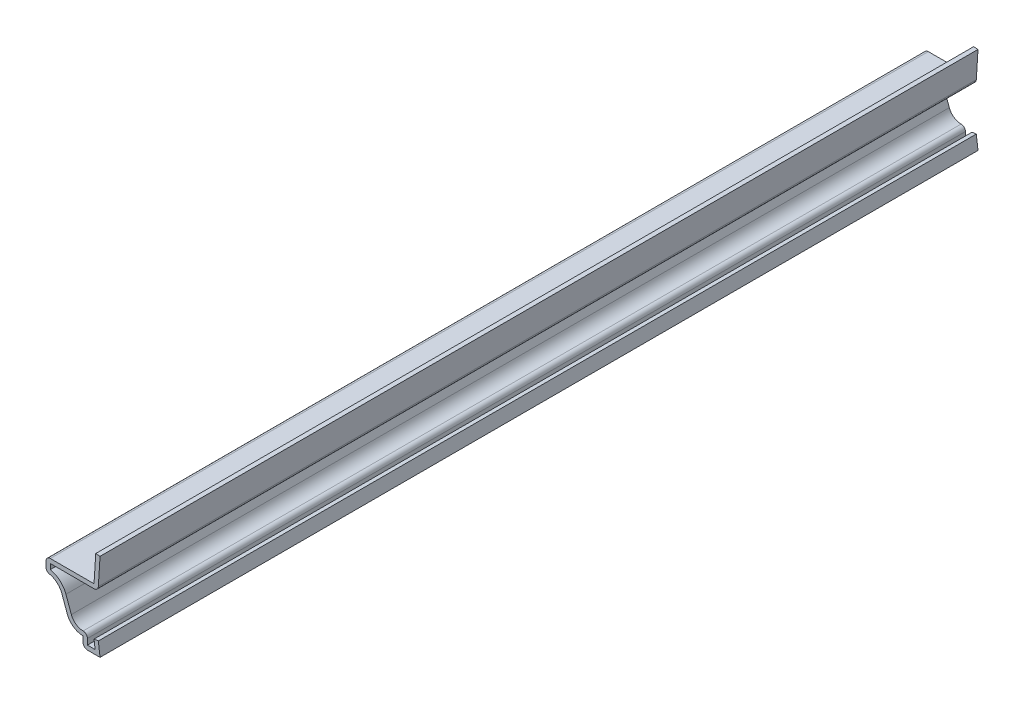
ISO-10303-21;
HEADER;
FILE_DESCRIPTION(('STEP AP214'),'2;1');
FILE_NAME('part.step','',(''),(''),'','','');
FILE_SCHEMA(('AUTOMOTIVE_DESIGN { 1 0 10303 214 1 1 1 1 }'));
ENDSEC;
DATA;
#1=APPLICATION_CONTEXT('core data for automotive mechanical design processes');
#2=APPLICATION_PROTOCOL_DEFINITION('international standard','automotive_design',2000,#1);
#3=PRODUCT_CONTEXT('',#1,'mechanical');
#4=PRODUCT('Part','Part','',(#3));
#5=PRODUCT_RELATED_PRODUCT_CATEGORY('part','',(#4));
#6=PRODUCT_DEFINITION_FORMATION('','',#4);
#7=PRODUCT_DEFINITION_CONTEXT('part definition',#1,'design');
#8=PRODUCT_DEFINITION('design','',#6,#7);
#9=PRODUCT_DEFINITION_SHAPE('','',#8);
#10=(LENGTH_UNIT() NAMED_UNIT(*) SI_UNIT(.MILLI.,.METRE.));
#11=(NAMED_UNIT(*) PLANE_ANGLE_UNIT() SI_UNIT($,.RADIAN.));
#12=(NAMED_UNIT(*) SI_UNIT($,.STERADIAN.) SOLID_ANGLE_UNIT());
#13=UNCERTAINTY_MEASURE_WITH_UNIT(LENGTH_MEASURE(1.E-05),#10,'distance_accuracy_value','');
#14=(GEOMETRIC_REPRESENTATION_CONTEXT(3) GLOBAL_UNCERTAINTY_ASSIGNED_CONTEXT((#13)) GLOBAL_UNIT_ASSIGNED_CONTEXT((#10,
#11,#12)) REPRESENTATION_CONTEXT('',''));
#15=CARTESIAN_POINT('',(0.,0.,0.));
#16=DIRECTION('',(0.,0.,1.));
#17=DIRECTION('',(1.,0.,0.));
#18=AXIS2_PLACEMENT_3D('',#15,#16,#17);
#19=CARTESIAN_POINT('',(0.,0.,-206.375));
#20=DIRECTION('',(0.992156741649221,0.125,0.));
#21=DIRECTION('',(-0.125,0.992156741649222,0.));
#22=AXIS2_PLACEMENT_3D('',#19,#20,#21);
#23=PLANE('',#22);
#24=DIRECTION('',(-0.125,0.992156741649221,0.));
#25=VECTOR('',#24,1.);
#26=CARTESIAN_POINT('',(0.,0.,0.));
#27=LINE('',#26,#25);
#28=CARTESIAN_POINT('',(0.,0.,0.));
#29=VERTEX_POINT('',#28);
#30=CARTESIAN_POINT('',(-0.396875,3.15009765473628,0.));
#31=VERTEX_POINT('',#30);
#32=EDGE_CURVE('E274',#29,#31,#27,.T.);
#33=ORIENTED_EDGE('',*,*,#32,.F.);
#34=DIRECTION('',(0.,0.,1.));
#35=VECTOR('',#34,1.);
#36=CARTESIAN_POINT('',(0.,0.,-206.375));
#37=LINE('',#36,#35);
#38=CARTESIAN_POINT('',(0.,0.,-206.375));
#39=VERTEX_POINT('',#38);
#40=EDGE_CURVE('E227',#39,#29,#37,.T.);
#41=ORIENTED_EDGE('',*,*,#40,.F.);
#42=DIRECTION('',(-0.125,0.992156741649221,0.));
#43=VECTOR('',#42,1.);
#44=CARTESIAN_POINT('',(0.,0.,-206.375));
#45=LINE('',#44,#43);
#46=CARTESIAN_POINT('',(-0.396875,3.15009765473628,-206.375));
#47=VERTEX_POINT('',#46);
#48=EDGE_CURVE('E207',#39,#47,#45,.T.);
#49=ORIENTED_EDGE('',*,*,#48,.T.);
#50=DIRECTION('',(0.,0.,1.));
#51=VECTOR('',#50,1.);
#52=CARTESIAN_POINT('',(-0.396875,3.15009765473628,-206.375));
#53=LINE('',#52,#51);
#54=EDGE_CURVE('E215',#47,#31,#53,.T.);
#55=ORIENTED_EDGE('',*,*,#54,.T.);
#56=EDGE_LOOP('',(#33,#41,#49,#55));
#57=FACE_BOUND('',#56,.T.);
#58=ADVANCED_FACE('F35',(#57),#23,.T.);
#59=CARTESIAN_POINT('',(-3.96875,0.,-206.375));
#60=DIRECTION('',(0.,-1.,0.));
#61=DIRECTION('',(0.,0.,-1.));
#62=AXIS2_PLACEMENT_3D('',#59,#60,#61);
#63=PLANE('',#62);
#64=DIRECTION('',(1.,0.,0.));
#65=VECTOR('',#64,1.);
#66=CARTESIAN_POINT('',(-3.96875,0.,0.));
#67=LINE('',#66,#65);
#68=CARTESIAN_POINT('',(-2.95275,0.,0.));
#69=VERTEX_POINT('',#68);
#70=EDGE_CURVE('E228',#69,#29,#67,.T.);
#71=ORIENTED_EDGE('',*,*,#70,.F.);
#72=DIRECTION('',(0.,0.,1.));
#73=VECTOR('',#72,1.);
#74=CARTESIAN_POINT('',(-2.95275,0.,-206.375));
#75=LINE('',#74,#73);
#76=CARTESIAN_POINT('',(-2.95275,0.,-206.375));
#77=VERTEX_POINT('',#76);
#78=EDGE_CURVE('E364',#69,#77,#75,.F.);
#79=ORIENTED_EDGE('',*,*,#78,.T.);
#80=DIRECTION('',(1.,0.,0.));
#81=VECTOR('',#80,1.);
#82=CARTESIAN_POINT('',(-3.96875,0.,-206.375));
#83=LINE('',#82,#81);
#84=EDGE_CURVE('E223',#77,#39,#83,.T.);
#85=ORIENTED_EDGE('',*,*,#84,.T.);
#86=ORIENTED_EDGE('',*,*,#40,.T.);
#87=EDGE_LOOP('',(#71,#79,#85,#86));
#88=FACE_BOUND('',#87,.T.);
#89=ADVANCED_FACE('F467',(#88),#63,.T.);
#90=CARTESIAN_POINT('',(-3.96875,2.38125,-206.375));
#91=DIRECTION('',(-1.,0.,0.));
#92=DIRECTION('',(0.,0.,1.));
#93=AXIS2_PLACEMENT_3D('',#90,#91,#92);
#94=PLANE('',#93);
#95=DIRECTION('',(0.,-1.,0.));
#96=VECTOR('',#95,1.);
#97=CARTESIAN_POINT('',(-3.96875,2.38125,-206.375));
#98=LINE('',#97,#96);
#99=CARTESIAN_POINT('',(-3.96875,2.38125,-206.375));
#100=VERTEX_POINT('',#99);
#101=CARTESIAN_POINT('',(-3.96875,1.016,-206.375));
#102=VERTEX_POINT('',#101);
#103=EDGE_CURVE('E270',#100,#102,#98,.T.);
#104=ORIENTED_EDGE('',*,*,#103,.T.);
#105=DIRECTION('',(0.,0.,1.));
#106=VECTOR('',#105,1.);
#107=CARTESIAN_POINT('',(-3.96875,1.016,-206.375));
#108=LINE('',#107,#106);
#109=CARTESIAN_POINT('',(-3.96875,1.016,0.));
#110=VERTEX_POINT('',#109);
#111=EDGE_CURVE('E318',#102,#110,#108,.T.);
#112=ORIENTED_EDGE('',*,*,#111,.T.);
#113=DIRECTION('',(0.,-1.,0.));
#114=VECTOR('',#113,1.);
#115=CARTESIAN_POINT('',(-3.96875,2.38125,0.));
#116=LINE('',#115,#114);
#117=CARTESIAN_POINT('',(-3.96875,2.38125,0.));
#118=VERTEX_POINT('',#117);
#119=EDGE_CURVE('E230',#118,#110,#116,.T.);
#120=ORIENTED_EDGE('',*,*,#119,.F.);
#121=DIRECTION('',(0.,0.,1.));
#122=VECTOR('',#121,1.);
#123=CARTESIAN_POINT('',(-3.96875,2.38125,-206.375));
#124=LINE('',#123,#122);
#125=EDGE_CURVE('E319',#100,#118,#124,.T.);
#126=ORIENTED_EDGE('',*,*,#125,.F.);
#127=EDGE_LOOP('',(#104,#112,#120,#126));
#128=FACE_BOUND('',#127,.T.);
#129=ADVANCED_FACE('F459',(#128),#94,.T.);
#130=CARTESIAN_POINT('',(-3.96875,6.35,-206.375));
#131=DIRECTION('',(0.,0.,1.));
#132=DIRECTION('',(1.,0.,0.));
#133=AXIS2_PLACEMENT_3D('',#130,#131,#132);
#134=CYLINDRICAL_SURFACE('',#133,3.96875);
#135=CARTESIAN_POINT('',(-3.96875,6.35,0.));
#136=DIRECTION('',(0.,0.,1.));
#137=DIRECTION('',(1.,0.,0.));
#138=AXIS2_PLACEMENT_3D('',#135,#136,#137);
#139=CIRCLE('',#138,3.96875);
#140=CARTESIAN_POINT('',(-7.69971383235081,4.99689784414105,0.));
#141=VERTEX_POINT('',#140);
#142=EDGE_CURVE('E312',#141,#118,#139,.T.);
#143=ORIENTED_EDGE('',*,*,#142,.F.);
#144=DIRECTION('',(0.,0.,1.));
#145=VECTOR('',#144,1.);
#146=CARTESIAN_POINT('',(-7.69971383235081,4.99689784414105,-206.375));
#147=LINE('',#146,#145);
#148=CARTESIAN_POINT('',(-7.69971383235081,4.99689784414105,-206.375));
#149=VERTEX_POINT('',#148);
#150=EDGE_CURVE('E321',#149,#141,#147,.T.);
#151=ORIENTED_EDGE('',*,*,#150,.F.);
#152=CARTESIAN_POINT('',(-3.96875,6.35,-206.375));
#153=DIRECTION('',(0.,0.,1.));
#154=DIRECTION('',(1.,0.,0.));
#155=AXIS2_PLACEMENT_3D('',#152,#153,#154);
#156=CIRCLE('',#155,3.96875);
#157=EDGE_CURVE('E267',#149,#100,#156,.T.);
#158=ORIENTED_EDGE('',*,*,#157,.T.);
#159=ORIENTED_EDGE('',*,*,#125,.T.);
#160=EDGE_LOOP('',(#143,#151,#158,#159));
#161=FACE_BOUND('',#160,.T.);
#162=ADVANCED_FACE('F455',(#161),#134,.T.);
#163=CARTESIAN_POINT('',(-8.96903616764919,8.49685215585895,-206.375));
#164=DIRECTION('',(-0.94008537508052,-0.34093912588572,0.));
#165=DIRECTION('',(0.34093912588572,-0.94008537508052,0.));
#166=AXIS2_PLACEMENT_3D('',#163,#164,#165);
#167=PLANE('',#166);
#168=DIRECTION('',(0.34093912588572,-0.94008537508052,0.));
#169=VECTOR('',#168,1.);
#170=CARTESIAN_POINT('',(-8.96903616764919,8.49685215585895,0.));
#171=LINE('',#170,#169);
#172=CARTESIAN_POINT('',(-8.96903616764919,8.49685215585895,0.));
#173=VERTEX_POINT('',#172);
#174=EDGE_CURVE('E309',#173,#141,#171,.T.);
#175=ORIENTED_EDGE('',*,*,#174,.F.);
#176=DIRECTION('',(0.,0.,1.));
#177=VECTOR('',#176,1.);
#178=CARTESIAN_POINT('',(-8.96903616764919,8.49685215585895,-206.375));
#179=LINE('',#178,#177);
#180=CARTESIAN_POINT('',(-8.96903616764919,8.49685215585895,-206.375));
#181=VERTEX_POINT('',#180);
#182=EDGE_CURVE('E323',#181,#173,#179,.T.);
#183=ORIENTED_EDGE('',*,*,#182,.F.);
#184=DIRECTION('',(0.34093912588572,-0.94008537508052,0.));
#185=VECTOR('',#184,1.);
#186=CARTESIAN_POINT('',(-8.96903616764919,8.49685215585895,-206.375));
#187=LINE('',#186,#185);
#188=EDGE_CURVE('E264',#181,#149,#187,.T.);
#189=ORIENTED_EDGE('',*,*,#188,.T.);
#190=ORIENTED_EDGE('',*,*,#150,.T.);
#191=EDGE_LOOP('',(#175,#183,#189,#190));
#192=FACE_BOUND('',#191,.T.);
#193=ADVANCED_FACE('F451',(#192),#167,.T.);
#194=CARTESIAN_POINT('',(-12.7,7.14375,-206.375));
#195=DIRECTION('',(0.,0.,1.));
#196=DIRECTION('',(1.,0.,0.));
#197=AXIS2_PLACEMENT_3D('',#194,#195,#196);
#198=CYLINDRICAL_SURFACE('',#197,3.96875);
#199=CARTESIAN_POINT('',(-12.7,7.14375,0.));
#200=DIRECTION('',(0.,0.,-1.));
#201=DIRECTION('',(-1.,0.,0.));
#202=AXIS2_PLACEMENT_3D('',#199,#200,#201);
#203=CIRCLE('',#202,3.96875);
#204=CARTESIAN_POINT('',(-11.8910828025478,11.0291881387645,0.));
#205=VERTEX_POINT('',#204);
#206=EDGE_CURVE('E307',#205,#173,#203,.T.);
#207=ORIENTED_EDGE('',*,*,#206,.F.);
#208=DIRECTION('',(0.,0.,1.));
#209=VECTOR('',#208,1.);
#210=CARTESIAN_POINT('',(-11.8910828025478,11.0291881387645,-206.375));
#211=LINE('',#210,#209);
#212=CARTESIAN_POINT('',(-11.8910828025478,11.0291881387645,-206.375));
#213=VERTEX_POINT('',#212);
#214=EDGE_CURVE('E384',#205,#213,#211,.F.);
#215=ORIENTED_EDGE('',*,*,#214,.T.);
#216=CARTESIAN_POINT('',(-12.7,7.14375,-206.375));
#217=DIRECTION('',(0.,0.,-1.));
#218=DIRECTION('',(-1.,0.,0.));
#219=AXIS2_PLACEMENT_3D('',#216,#217,#218);
#220=CIRCLE('',#219,3.96875);
#221=EDGE_CURVE('E262',#213,#181,#220,.T.);
#222=ORIENTED_EDGE('',*,*,#221,.T.);
#223=ORIENTED_EDGE('',*,*,#182,.T.);
#224=EDGE_LOOP('',(#207,#215,#222,#223));
#225=FACE_BOUND('',#224,.T.);
#226=ADVANCED_FACE('F446',(#225),#198,.F.);
#227=CARTESIAN_POINT('',(-12.7,14.2875,-206.375));
#228=DIRECTION('',(-1.,0.,0.));
#229=DIRECTION('',(0.,-1.,0.));
#230=AXIS2_PLACEMENT_3D('',#227,#228,#229);
#231=PLANE('',#230);
#232=DIRECTION('',(0.,-1.,0.));
#233=VECTOR('',#232,1.);
#234=CARTESIAN_POINT('',(-12.7,14.2875,-206.375));
#235=LINE('',#234,#233);
#236=CARTESIAN_POINT('',(-12.7,13.2715,-206.375));
#237=VERTEX_POINT('',#236);
#238=CARTESIAN_POINT('',(-12.7,12.0238603022883,-206.375));
#239=VERTEX_POINT('',#238);
#240=EDGE_CURVE('E259',#237,#239,#235,.T.);
#241=ORIENTED_EDGE('',*,*,#240,.T.);
#242=DIRECTION('',(0.,0.,1.));
#243=VECTOR('',#242,1.);
#244=CARTESIAN_POINT('',(-12.7,12.0238603022883,-206.375));
#245=LINE('',#244,#243);
#246=CARTESIAN_POINT('',(-12.7,12.0238603022883,0.));
#247=VERTEX_POINT('',#246);
#248=EDGE_CURVE('E381',#239,#247,#245,.T.);
#249=ORIENTED_EDGE('',*,*,#248,.T.);
#250=DIRECTION('',(0.,-1.,0.));
#251=VECTOR('',#250,1.);
#252=CARTESIAN_POINT('',(-12.7,14.2875,0.));
#253=LINE('',#252,#251);
#254=CARTESIAN_POINT('',(-12.7,13.2715,0.));
#255=VERTEX_POINT('',#254);
#256=EDGE_CURVE('E304',#255,#247,#253,.T.);
#257=ORIENTED_EDGE('',*,*,#256,.F.);
#258=DIRECTION('',(0.,0.,1.));
#259=VECTOR('',#258,1.);
#260=CARTESIAN_POINT('',(-12.7,13.2715,-206.375));
#261=LINE('',#260,#259);
#262=EDGE_CURVE('E379',#255,#237,#261,.F.);
#263=ORIENTED_EDGE('',*,*,#262,.T.);
#264=EDGE_LOOP('',(#241,#249,#257,#263));
#265=FACE_BOUND('',#264,.T.);
#266=ADVANCED_FACE('F434',(#265),#231,.T.);
#267=CARTESIAN_POINT('',(-1.41089641973861,14.2875,-206.375));
#268=DIRECTION('',(0.,1.,0.));
#269=DIRECTION('',(-1.,0.,0.));
#270=AXIS2_PLACEMENT_3D('',#267,#268,#269);
#271=PLANE('',#270);
#272=DIRECTION('',(-1.,0.,0.));
#273=VECTOR('',#272,1.);
#274=CARTESIAN_POINT('',(-1.41089641973861,14.2875,-206.375));
#275=LINE('',#274,#273);
#276=CARTESIAN_POINT('',(-1.41089641973861,14.2875,-206.375));
#277=VERTEX_POINT('',#276);
#278=CARTESIAN_POINT('',(-11.684,14.2875,-206.375));
#279=VERTEX_POINT('',#278);
#280=EDGE_CURVE('E256',#277,#279,#275,.T.);
#281=ORIENTED_EDGE('',*,*,#280,.T.);
#282=DIRECTION('',(0.,0.,1.));
#283=VECTOR('',#282,1.);
#284=CARTESIAN_POINT('',(-11.684,14.2875,-206.375));
#285=LINE('',#284,#283);
#286=CARTESIAN_POINT('',(-11.684,14.2875,0.));
#287=VERTEX_POINT('',#286);
#288=EDGE_CURVE('E386',#279,#287,#285,.T.);
#289=ORIENTED_EDGE('',*,*,#288,.T.);
#290=DIRECTION('',(-1.,0.,0.));
#291=VECTOR('',#290,1.);
#292=CARTESIAN_POINT('',(-1.41089641973861,14.2875,0.));
#293=LINE('',#292,#291);
#294=CARTESIAN_POINT('',(-1.41089641973861,14.2875,0.));
#295=VERTEX_POINT('',#294);
#296=EDGE_CURVE('E301',#295,#287,#293,.T.);
#297=ORIENTED_EDGE('',*,*,#296,.F.);
#298=DIRECTION('',(0.,0.,1.));
#299=VECTOR('',#298,1.);
#300=CARTESIAN_POINT('',(-1.41089641973861,14.2875,-206.375));
#301=LINE('',#300,#299);
#302=EDGE_CURVE('E326',#277,#295,#301,.T.);
#303=ORIENTED_EDGE('',*,*,#302,.F.);
#304=EDGE_LOOP('',(#281,#289,#297,#303));
#305=FACE_BOUND('',#304,.T.);
#306=ADVANCED_FACE('F428',(#305),#271,.T.);
#307=CARTESIAN_POINT('',(-1.01402141973861,20.6375,-206.375));
#308=DIRECTION('',(-0.998052578482889,0.0623782861551808,0.));
#309=DIRECTION('',(-0.0623782861551808,-0.998052578482889,0.));
#310=AXIS2_PLACEMENT_3D('',#307,#308,#309);
#311=PLANE('',#310);
#312=DIRECTION('',(-0.0623782861551808,-0.998052578482889,0.));
#313=VECTOR('',#312,1.);
#314=CARTESIAN_POINT('',(-1.01402141973861,20.6375,0.));
#315=LINE('',#314,#313);
#316=CARTESIAN_POINT('',(-1.01402141973861,20.6375,0.));
#317=VERTEX_POINT('',#316);
#318=EDGE_CURVE('E298',#317,#295,#315,.T.);
#319=ORIENTED_EDGE('',*,*,#318,.F.);
#320=DIRECTION('',(0.,0.,1.));
#321=VECTOR('',#320,1.);
#322=CARTESIAN_POINT('',(-1.01402141973861,20.6375,-206.375));
#323=LINE('',#322,#321);
#324=CARTESIAN_POINT('',(-1.01402141973861,20.6375,-206.375));
#325=VERTEX_POINT('',#324);
#326=EDGE_CURVE('E328',#325,#317,#323,.T.);
#327=ORIENTED_EDGE('',*,*,#326,.F.);
#328=DIRECTION('',(-0.0623782861551808,-0.998052578482889,0.));
#329=VECTOR('',#328,1.);
#330=CARTESIAN_POINT('',(-1.01402141973861,20.6375,-206.375));
#331=LINE('',#330,#329);
#332=EDGE_CURVE('E253',#325,#277,#331,.T.);
#333=ORIENTED_EDGE('',*,*,#332,.T.);
#334=ORIENTED_EDGE('',*,*,#302,.T.);
#335=EDGE_LOOP('',(#319,#327,#333,#334));
#336=FACE_BOUND('',#335,.T.);
#337=ADVANCED_FACE('F422',(#336),#311,.T.);
#338=CARTESIAN_POINT('',(-1.01402141973861,20.6375,-206.375));
#339=DIRECTION('',(-0.0623782861551802,-0.998052578482889,0.));
#340=DIRECTION('',(0.998052578482889,-0.0623782861551802,0.));
#341=AXIS2_PLACEMENT_3D('',#338,#339,#340);
#342=PLANE('',#341);
#343=DIRECTION('',(0.998052578482889,-0.0623782861551802,0.));
#344=VECTOR('',#343,1.);
#345=CARTESIAN_POINT('',(-1.01402141973861,20.6375,0.));
#346=LINE('',#345,#344);
#347=CARTESIAN_POINT('',(0.,20.5741236612663,0.));
#348=VERTEX_POINT('',#347);
#349=EDGE_CURVE('E296',#317,#348,#346,.T.);
#350=ORIENTED_EDGE('',*,*,#349,.T.);
#351=DIRECTION('',(0.,0.,1.));
#352=VECTOR('',#351,1.);
#353=CARTESIAN_POINT('',(0.,20.5741236612663,-206.375));
#354=LINE('',#353,#352);
#355=CARTESIAN_POINT('',(0.,20.5741236612663,-206.375));
#356=VERTEX_POINT('',#355);
#357=EDGE_CURVE('E330',#356,#348,#354,.T.);
#358=ORIENTED_EDGE('',*,*,#357,.F.);
#359=DIRECTION('',(0.998052578482889,-0.0623782861551802,0.));
#360=VECTOR('',#359,1.);
#361=CARTESIAN_POINT('',(-1.01402141973861,20.6375,-206.375));
#362=LINE('',#361,#360);
#363=EDGE_CURVE('E251',#325,#356,#362,.T.);
#364=ORIENTED_EDGE('',*,*,#363,.F.);
#365=ORIENTED_EDGE('',*,*,#326,.T.);
#366=EDGE_LOOP('',(#350,#358,#364,#365));
#367=FACE_BOUND('',#366,.T.);
#368=ADVANCED_FACE('F522',(#367),#342,.F.);
#369=CARTESIAN_POINT('',(0.,20.5741236612663,-206.375));
#370=DIRECTION('',(-0.998052578482889,0.0623782861551808,0.));
#371=DIRECTION('',(-0.0623782861551808,-0.998052578482889,0.));
#372=AXIS2_PLACEMENT_3D('',#369,#370,#371);
#373=PLANE('',#372);
#374=DIRECTION('',(-0.0623782861551808,-0.998052578482889,0.));
#375=VECTOR('',#374,1.);
#376=CARTESIAN_POINT('',(0.,20.5741236612663,0.));
#377=LINE('',#376,#375);
#378=CARTESIAN_POINT('',(-0.396875,14.2241236612663,0.));
#379=VERTEX_POINT('',#378);
#380=EDGE_CURVE('E293',#348,#379,#377,.T.);
#381=ORIENTED_EDGE('',*,*,#380,.T.);
#382=DIRECTION('',(0.,0.,1.));
#383=VECTOR('',#382,1.);
#384=CARTESIAN_POINT('',(-0.396875,14.2241236612663,-206.375));
#385=LINE('',#384,#383);
#386=CARTESIAN_POINT('',(-0.396875,14.2241236612663,-206.375));
#387=VERTEX_POINT('',#386);
#388=EDGE_CURVE('E11',#379,#387,#385,.F.);
#389=ORIENTED_EDGE('',*,*,#388,.T.);
#390=DIRECTION('',(-0.0623782861551808,-0.998052578482889,0.));
#391=VECTOR('',#390,1.);
#392=CARTESIAN_POINT('',(0.,20.5741236612663,-206.375));
#393=LINE('',#392,#391);
#394=EDGE_CURVE('E248',#356,#387,#393,.T.);
#395=ORIENTED_EDGE('',*,*,#394,.F.);
#396=ORIENTED_EDGE('',*,*,#357,.T.);
#397=EDGE_LOOP('',(#381,#389,#395,#396));
#398=FACE_BOUND('',#397,.T.);
#399=ADVANCED_FACE('F416',(#398),#373,.F.);
#400=CARTESIAN_POINT('',(-1.41089641973861,13.2715,-206.375));
#401=DIRECTION('',(0.,1.,0.));
#402=DIRECTION('',(-1.,0.,0.));
#403=AXIS2_PLACEMENT_3D('',#400,#401,#402);
#404=PLANE('',#403);
#405=DIRECTION('',(-1.,0.,0.));
#406=VECTOR('',#405,1.);
#407=CARTESIAN_POINT('',(-1.41089641973861,13.2715,-206.375));
#408=LINE('',#407,#406);
#409=CARTESIAN_POINT('',(-1.41089641973861,13.2715,-206.375));
#410=VERTEX_POINT('',#409);
#411=CARTESIAN_POINT('',(-11.684,13.2715,-206.375));
#412=VERTEX_POINT('',#411);
#413=EDGE_CURVE('E246',#410,#412,#408,.T.);
#414=ORIENTED_EDGE('',*,*,#413,.F.);
#415=DIRECTION('',(0.,0.,1.));
#416=VECTOR('',#415,1.);
#417=CARTESIAN_POINT('',(-1.41089641973861,13.2715,-206.375));
#418=LINE('',#417,#416);
#419=CARTESIAN_POINT('',(-1.41089641973861,13.2715,0.));
#420=VERTEX_POINT('',#419);
#421=EDGE_CURVE('E43',#410,#420,#418,.T.);
#422=ORIENTED_EDGE('',*,*,#421,.T.);
#423=DIRECTION('',(-1.,0.,0.));
#424=VECTOR('',#423,1.);
#425=CARTESIAN_POINT('',(-1.41089641973861,13.2715,0.));
#426=LINE('',#425,#424);
#427=CARTESIAN_POINT('',(-11.684,13.2715,0.));
#428=VERTEX_POINT('',#427);
#429=EDGE_CURVE('E291',#420,#428,#426,.T.);
#430=ORIENTED_EDGE('',*,*,#429,.T.);
#431=DIRECTION('',(0.,0.,1.));
#432=VECTOR('',#431,1.);
#433=CARTESIAN_POINT('',(-11.684,13.2715,-206.375));
#434=LINE('',#433,#432);
#435=EDGE_CURVE('E333',#412,#428,#434,.T.);
#436=ORIENTED_EDGE('',*,*,#435,.F.);
#437=EDGE_LOOP('',(#414,#422,#430,#436));
#438=FACE_BOUND('',#437,.T.);
#439=ADVANCED_FACE('F393',(#438),#404,.F.);
#440=CARTESIAN_POINT('',(-11.684,14.2875,-206.375));
#441=DIRECTION('',(-1.,0.,0.));
#442=DIRECTION('',(0.,-1.,0.));
#443=AXIS2_PLACEMENT_3D('',#440,#441,#442);
#444=PLANE('',#443);
#445=DIRECTION('',(0.,-1.,0.));
#446=VECTOR('',#445,1.);
#447=CARTESIAN_POINT('',(-11.684,14.2875,0.));
#448=LINE('',#447,#446);
#449=CARTESIAN_POINT('',(-11.684,12.0238603022883,0.));
#450=VERTEX_POINT('',#449);
#451=EDGE_CURVE('E289',#428,#450,#448,.T.);
#452=ORIENTED_EDGE('',*,*,#451,.T.);
#453=DIRECTION('',(0.,0.,1.));
#454=VECTOR('',#453,1.);
#455=CARTESIAN_POINT('',(-11.684,12.0238603022883,-206.375));
#456=LINE('',#455,#454);
#457=CARTESIAN_POINT('',(-11.684,12.0238603022883,-206.375));
#458=VERTEX_POINT('',#457);
#459=EDGE_CURVE('E336',#458,#450,#456,.T.);
#460=ORIENTED_EDGE('',*,*,#459,.F.);
#461=DIRECTION('',(0.,-1.,0.));
#462=VECTOR('',#461,1.);
#463=CARTESIAN_POINT('',(-11.684,14.2875,-206.375));
#464=LINE('',#463,#462);
#465=EDGE_CURVE('E244',#412,#458,#464,.T.);
#466=ORIENTED_EDGE('',*,*,#465,.F.);
#467=ORIENTED_EDGE('',*,*,#435,.T.);
#468=EDGE_LOOP('',(#452,#460,#466,#467));
#469=FACE_BOUND('',#468,.T.);
#470=ADVANCED_FACE('F405',(#469),#444,.F.);
#471=CARTESIAN_POINT('',(-12.7,7.14375,-206.375));
#472=DIRECTION('',(0.,0.,1.));
#473=DIRECTION('',(1.,0.,0.));
#474=AXIS2_PLACEMENT_3D('',#471,#472,#473);
#475=CYLINDRICAL_SURFACE('',#474,4.98475);
#476=CARTESIAN_POINT('',(-12.7,7.14375,0.));
#477=DIRECTION('',(0.,0.,1.));
#478=DIRECTION('',(1.,0.,0.));
#479=AXIS2_PLACEMENT_3D('',#476,#477,#478);
#480=CIRCLE('',#479,4.98475);
#481=CARTESIAN_POINT('',(-8.01390942656738,8.84324630775884,0.));
#482=VERTEX_POINT('',#481);
#483=EDGE_CURVE('E287',#450,#482,#480,.F.);
#484=ORIENTED_EDGE('',*,*,#483,.T.);
#485=DIRECTION('',(0.,0.,1.));
#486=VECTOR('',#485,1.);
#487=CARTESIAN_POINT('',(-8.01390942656738,8.84324630775884,-206.375));
#488=LINE('',#487,#486);
#489=CARTESIAN_POINT('',(-8.01390942656738,8.84324630775884,-206.375));
#490=VERTEX_POINT('',#489);
#491=EDGE_CURVE('E339',#490,#482,#488,.T.);
#492=ORIENTED_EDGE('',*,*,#491,.F.);
#493=CARTESIAN_POINT('',(-12.7,7.14375,-206.375));
#494=DIRECTION('',(0.,0.,1.));
#495=DIRECTION('',(1.,0.,0.));
#496=AXIS2_PLACEMENT_3D('',#493,#494,#495);
#497=CIRCLE('',#496,4.98475);
#498=EDGE_CURVE('E242',#458,#490,#497,.F.);
#499=ORIENTED_EDGE('',*,*,#498,.F.);
#500=ORIENTED_EDGE('',*,*,#459,.T.);
#501=EDGE_LOOP('',(#484,#492,#499,#500));
#502=FACE_BOUND('',#501,.T.);
#503=ADVANCED_FACE('F409',(#502),#475,.T.);
#504=CARTESIAN_POINT('',(-8.01390942656738,8.84324630775884,-206.375));
#505=DIRECTION('',(-0.94008537508052,-0.34093912588572,0.));
#506=DIRECTION('',(0.34093912588572,-0.94008537508052,0.));
#507=AXIS2_PLACEMENT_3D('',#504,#505,#506);
#508=PLANE('',#507);
#509=DIRECTION('',(0.34093912588572,-0.94008537508052,0.));
#510=VECTOR('',#509,1.);
#511=CARTESIAN_POINT('',(-8.01390942656738,8.84324630775884,0.));
#512=LINE('',#511,#510);
#513=CARTESIAN_POINT('',(-6.744587091269,5.34329199604094,0.));
#514=VERTEX_POINT('',#513);
#515=EDGE_CURVE('E285',#482,#514,#512,.T.);
#516=ORIENTED_EDGE('',*,*,#515,.T.);
#517=DIRECTION('',(0.,0.,1.));
#518=VECTOR('',#517,1.);
#519=CARTESIAN_POINT('',(-6.744587091269,5.34329199604094,-206.375));
#520=LINE('',#519,#518);
#521=CARTESIAN_POINT('',(-6.744587091269,5.34329199604094,-206.375));
#522=VERTEX_POINT('',#521);
#523=EDGE_CURVE('E342',#522,#514,#520,.T.);
#524=ORIENTED_EDGE('',*,*,#523,.F.);
#525=DIRECTION('',(0.34093912588572,-0.94008537508052,0.));
#526=VECTOR('',#525,1.);
#527=CARTESIAN_POINT('',(-8.01390942656738,8.84324630775884,-206.375));
#528=LINE('',#527,#526);
#529=EDGE_CURVE('E240',#490,#522,#528,.T.);
#530=ORIENTED_EDGE('',*,*,#529,.F.);
#531=ORIENTED_EDGE('',*,*,#491,.T.);
#532=EDGE_LOOP('',(#516,#524,#530,#531));
#533=FACE_BOUND('',#532,.T.);
#534=ADVANCED_FACE('F510',(#533),#508,.F.);
#535=CARTESIAN_POINT('',(-3.96875,6.35,-206.375));
#536=DIRECTION('',(0.,0.,1.));
#537=DIRECTION('',(1.,0.,0.));
#538=AXIS2_PLACEMENT_3D('',#535,#536,#537);
#539=CYLINDRICAL_SURFACE('',#538,2.95275);
#540=CARTESIAN_POINT('',(-3.96875,6.35,0.));
#541=DIRECTION('',(0.,0.,1.));
#542=DIRECTION('',(1.,0.,0.));
#543=AXIS2_PLACEMENT_3D('',#540,#541,#542);
#544=CIRCLE('',#543,2.95275);
#545=CARTESIAN_POINT('',(-3.96875,3.39725,0.));
#546=VERTEX_POINT('',#545);
#547=EDGE_CURVE('E283',#514,#546,#544,.T.);
#548=ORIENTED_EDGE('',*,*,#547,.T.);
#549=DIRECTION('',(0.,0.,1.));
#550=VECTOR('',#549,1.);
#551=CARTESIAN_POINT('',(-3.96875,3.39725,-206.375));
#552=LINE('',#551,#550);
#553=CARTESIAN_POINT('',(-3.96875,3.39725,-206.375));
#554=VERTEX_POINT('',#553);
#555=EDGE_CURVE('E58',#546,#554,#552,.F.);
#556=ORIENTED_EDGE('',*,*,#555,.T.);
#557=CARTESIAN_POINT('',(-3.96875,6.35,-206.375));
#558=DIRECTION('',(0.,0.,1.));
#559=DIRECTION('',(1.,0.,0.));
#560=AXIS2_PLACEMENT_3D('',#557,#558,#559);
#561=CIRCLE('',#560,2.95275);
#562=EDGE_CURVE('E238',#522,#554,#561,.T.);
#563=ORIENTED_EDGE('',*,*,#562,.F.);
#564=ORIENTED_EDGE('',*,*,#523,.T.);
#565=EDGE_LOOP('',(#548,#556,#563,#564));
#566=FACE_BOUND('',#565,.T.);
#567=ADVANCED_FACE('F483',(#566),#539,.F.);
#568=CARTESIAN_POINT('',(-2.95275,2.38125,-206.375));
#569=DIRECTION('',(-1.,0.,0.));
#570=DIRECTION('',(0.,0.,1.));
#571=AXIS2_PLACEMENT_3D('',#568,#569,#570);
#572=PLANE('',#571);
#573=DIRECTION('',(0.,1.,0.));
#574=VECTOR('',#573,1.);
#575=CARTESIAN_POINT('',(-2.95275,2.38125,-206.375));
#576=LINE('',#575,#574);
#577=CARTESIAN_POINT('',(-2.95275,2.38125,-206.375));
#578=VERTEX_POINT('',#577);
#579=CARTESIAN_POINT('',(-2.95275,1.016,-206.375));
#580=VERTEX_POINT('',#579);
#581=EDGE_CURVE('E236',#578,#580,#576,.F.);
#582=ORIENTED_EDGE('',*,*,#581,.F.);
#583=DIRECTION('',(0.,0.,1.));
#584=VECTOR('',#583,1.);
#585=CARTESIAN_POINT('',(-2.95275,2.38125,-206.375));
#586=LINE('',#585,#584);
#587=CARTESIAN_POINT('',(-2.95275,2.38125,0.));
#588=VERTEX_POINT('',#587);
#589=EDGE_CURVE('E375',#578,#588,#586,.T.);
#590=ORIENTED_EDGE('',*,*,#589,.T.);
#591=DIRECTION('',(0.,1.,0.));
#592=VECTOR('',#591,1.);
#593=CARTESIAN_POINT('',(-2.95275,2.38125,0.));
#594=LINE('',#593,#592);
#595=CARTESIAN_POINT('',(-2.95275,1.016,0.));
#596=VERTEX_POINT('',#595);
#597=EDGE_CURVE('E281',#588,#596,#594,.F.);
#598=ORIENTED_EDGE('',*,*,#597,.T.);
#599=DIRECTION('',(0.,0.,1.));
#600=VECTOR('',#599,1.);
#601=CARTESIAN_POINT('',(-2.95275,1.016,-206.375));
#602=LINE('',#601,#600);
#603=EDGE_CURVE('E345',#580,#596,#602,.T.);
#604=ORIENTED_EDGE('',*,*,#603,.F.);
#605=EDGE_LOOP('',(#582,#590,#598,#604));
#606=FACE_BOUND('',#605,.T.);
#607=ADVANCED_FACE('F479',(#606),#572,.F.);
#608=CARTESIAN_POINT('',(-3.96875,1.016,-206.375));
#609=DIRECTION('',(0.,-1.,0.));
#610=DIRECTION('',(0.,0.,-1.));
#611=AXIS2_PLACEMENT_3D('',#608,#609,#610);
#612=PLANE('',#611);
#613=DIRECTION('',(1.,0.,0.));
#614=VECTOR('',#613,1.);
#615=CARTESIAN_POINT('',(-3.96875,1.016,0.));
#616=LINE('',#615,#614);
#617=CARTESIAN_POINT('',(-1.15203571373212,1.016,0.));
#618=VERTEX_POINT('',#617);
#619=EDGE_CURVE('E279',#596,#618,#616,.T.);
#620=ORIENTED_EDGE('',*,*,#619,.T.);
#621=DIRECTION('',(0.,0.,1.));
#622=VECTOR('',#621,1.);
#623=CARTESIAN_POINT('',(-1.15203571373212,1.016,-206.375));
#624=LINE('',#623,#622);
#625=CARTESIAN_POINT('',(-1.15203571373212,1.016,-206.375));
#626=VERTEX_POINT('',#625);
#627=EDGE_CURVE('E348',#626,#618,#624,.T.);
#628=ORIENTED_EDGE('',*,*,#627,.F.);
#629=DIRECTION('',(1.,0.,0.));
#630=VECTOR('',#629,1.);
#631=CARTESIAN_POINT('',(-3.96875,1.016,-206.375));
#632=LINE('',#631,#630);
#633=EDGE_CURVE('E234',#580,#626,#632,.T.);
#634=ORIENTED_EDGE('',*,*,#633,.F.);
#635=ORIENTED_EDGE('',*,*,#603,.T.);
#636=EDGE_LOOP('',(#620,#628,#634,#635));
#637=FACE_BOUND('',#636,.T.);
#638=ADVANCED_FACE('F476',(#637),#612,.F.);
#639=CARTESIAN_POINT('',(-1.00803124951561,-0.127,-206.375));
#640=DIRECTION('',(0.992156741649221,0.125,0.));
#641=DIRECTION('',(-0.125,0.992156741649222,0.));
#642=AXIS2_PLACEMENT_3D('',#639,#640,#641);
#643=PLANE('',#642);
#644=DIRECTION('',(-0.125,0.992156741649221,0.));
#645=VECTOR('',#644,1.);
#646=CARTESIAN_POINT('',(-1.00803124951561,-0.127,0.));
#647=LINE('',#646,#645);
#648=CARTESIAN_POINT('',(-1.40490624951561,3.02309765473628,0.));
#649=VERTEX_POINT('',#648);
#650=EDGE_CURVE('E277',#618,#649,#647,.T.);
#651=ORIENTED_EDGE('',*,*,#650,.T.);
#652=DIRECTION('',(0.,0.,1.));
#653=VECTOR('',#652,1.);
#654=CARTESIAN_POINT('',(-1.40490624951561,3.02309765473628,-206.375));
#655=LINE('',#654,#653);
#656=CARTESIAN_POINT('',(-1.40490624951561,3.02309765473628,-206.375));
#657=VERTEX_POINT('',#656);
#658=EDGE_CURVE('E222',#657,#649,#655,.T.);
#659=ORIENTED_EDGE('',*,*,#658,.F.);
#660=DIRECTION('',(-0.125,0.992156741649221,0.));
#661=VECTOR('',#660,1.);
#662=CARTESIAN_POINT('',(-1.00803124951561,-0.127,-206.375));
#663=LINE('',#662,#661);
#664=EDGE_CURVE('E209',#626,#657,#663,.T.);
#665=ORIENTED_EDGE('',*,*,#664,.F.);
#666=ORIENTED_EDGE('',*,*,#627,.T.);
#667=EDGE_LOOP('',(#651,#659,#665,#666));
#668=FACE_BOUND('',#667,.T.);
#669=ADVANCED_FACE('F472',(#668),#643,.F.);
#670=CARTESIAN_POINT('',(-1.40490624951561,3.02309765473628,-206.375));
#671=DIRECTION('',(0.125,-0.992156741649222,0.));
#672=DIRECTION('',(0.992156741649222,0.125,0.));
#673=AXIS2_PLACEMENT_3D('',#670,#671,#672);
#674=PLANE('',#673);
#675=DIRECTION('',(0.992156741649222,0.125,0.));
#676=VECTOR('',#675,1.);
#677=CARTESIAN_POINT('',(-1.40490624951561,3.02309765473628,0.));
#678=LINE('',#677,#676);
#679=EDGE_CURVE('E218',#649,#31,#678,.T.);
#680=ORIENTED_EDGE('',*,*,#679,.T.);
#681=ORIENTED_EDGE('',*,*,#54,.F.);
#682=DIRECTION('',(0.992156741649222,0.125,0.));
#683=VECTOR('',#682,1.);
#684=CARTESIAN_POINT('',(-1.40490624951561,3.02309765473628,-206.375));
#685=LINE('',#684,#683);
#686=EDGE_CURVE('E202',#657,#47,#685,.T.);
#687=ORIENTED_EDGE('',*,*,#686,.F.);
#688=ORIENTED_EDGE('',*,*,#658,.T.);
#689=EDGE_LOOP('',(#680,#681,#687,#688));
#690=FACE_BOUND('',#689,.T.);
#691=ADVANCED_FACE('F216',(#690),#674,.F.);
#692=CARTESIAN_POINT('',(-3.96875,6.35,-206.375));
#693=DIRECTION('',(0.,0.,1.));
#694=DIRECTION('',(1.,0.,0.));
#695=AXIS2_PLACEMENT_3D('',#692,#693,#694);
#696=PLANE('',#695);
#697=ORIENTED_EDGE('',*,*,#84,.F.);
#698=CARTESIAN_POINT('',(-2.95275,1.016,-206.375));
#699=DIRECTION('',(0.,0.,1.));
#700=DIRECTION('',(1.,0.,0.));
#701=AXIS2_PLACEMENT_3D('',#698,#699,#700);
#702=CIRCLE('',#701,1.016);
#703=EDGE_CURVE('E373',#77,#102,#702,.F.);
#704=ORIENTED_EDGE('',*,*,#703,.T.);
#705=ORIENTED_EDGE('',*,*,#103,.F.);
#706=ORIENTED_EDGE('',*,*,#157,.F.);
#707=ORIENTED_EDGE('',*,*,#188,.F.);
#708=ORIENTED_EDGE('',*,*,#221,.F.);
#709=CARTESIAN_POINT('',(-11.684,12.0238603022883,-206.375));
#710=DIRECTION('',(0.,0.,1.));
#711=DIRECTION('',(1.,0.,0.));
#712=AXIS2_PLACEMENT_3D('',#709,#710,#711);
#713=CIRCLE('',#712,1.016);
#714=EDGE_CURVE('E370',#213,#239,#713,.F.);
#715=ORIENTED_EDGE('',*,*,#714,.T.);
#716=ORIENTED_EDGE('',*,*,#240,.F.);
#717=CARTESIAN_POINT('',(-11.684,13.2715,-206.375));
#718=DIRECTION('',(0.,0.,1.));
#719=DIRECTION('',(1.,0.,0.));
#720=AXIS2_PLACEMENT_3D('',#717,#718,#719);
#721=CIRCLE('',#720,1.016);
#722=EDGE_CURVE('E368',#237,#279,#721,.F.);
#723=ORIENTED_EDGE('',*,*,#722,.T.);
#724=ORIENTED_EDGE('',*,*,#280,.F.);
#725=ORIENTED_EDGE('',*,*,#332,.F.);
#726=ORIENTED_EDGE('',*,*,#363,.T.);
#727=ORIENTED_EDGE('',*,*,#394,.T.);
#728=CARTESIAN_POINT('',(-1.41089641973861,14.2875,-206.375));
#729=DIRECTION('',(0.,0.,1.));
#730=DIRECTION('',(1.,0.,0.));
#731=AXIS2_PLACEMENT_3D('',#728,#729,#730);
#732=CIRCLE('',#731,1.016);
#733=EDGE_CURVE('E366',#387,#410,#732,.F.);
#734=ORIENTED_EDGE('',*,*,#733,.T.);
#735=ORIENTED_EDGE('',*,*,#413,.T.);
#736=ORIENTED_EDGE('',*,*,#465,.T.);
#737=ORIENTED_EDGE('',*,*,#498,.T.);
#738=ORIENTED_EDGE('',*,*,#529,.T.);
#739=ORIENTED_EDGE('',*,*,#562,.T.);
#740=CARTESIAN_POINT('',(-3.96875,2.38125,-206.375));
#741=DIRECTION('',(0.,0.,1.));
#742=DIRECTION('',(1.,0.,0.));
#743=AXIS2_PLACEMENT_3D('',#740,#741,#742);
#744=CIRCLE('',#743,1.016);
#745=EDGE_CURVE('E50',#554,#578,#744,.F.);
#746=ORIENTED_EDGE('',*,*,#745,.T.);
#747=ORIENTED_EDGE('',*,*,#581,.T.);
#748=ORIENTED_EDGE('',*,*,#633,.T.);
#749=ORIENTED_EDGE('',*,*,#664,.T.);
#750=ORIENTED_EDGE('',*,*,#686,.T.);
#751=ORIENTED_EDGE('',*,*,#48,.F.);
#752=EDGE_LOOP('',(#697,#704,#705,#706,#707,#708,#715,#716,#723,#724,#725,#726,#727,#734,#735,
#736,#737,#738,#739,#746,#747,#748,#749,#750,#751));
#753=FACE_BOUND('',#752,.T.);
#754=ADVANCED_FACE('F205',(#753),#696,.F.);
#755=CARTESIAN_POINT('',(-3.96875,6.35,0.));
#756=DIRECTION('',(0.,0.,1.));
#757=DIRECTION('',(1.,0.,0.));
#758=AXIS2_PLACEMENT_3D('',#755,#756,#757);
#759=PLANE('',#758);
#760=ORIENTED_EDGE('',*,*,#119,.T.);
#761=CARTESIAN_POINT('',(-2.95275,1.016,0.));
#762=DIRECTION('',(0.,0.,1.));
#763=DIRECTION('',(1.,0.,0.));
#764=AXIS2_PLACEMENT_3D('',#761,#762,#763);
#765=CIRCLE('',#764,1.016);
#766=EDGE_CURVE('E362',#110,#69,#765,.T.);
#767=ORIENTED_EDGE('',*,*,#766,.T.);
#768=ORIENTED_EDGE('',*,*,#70,.T.);
#769=ORIENTED_EDGE('',*,*,#32,.T.);
#770=ORIENTED_EDGE('',*,*,#679,.F.);
#771=ORIENTED_EDGE('',*,*,#650,.F.);
#772=ORIENTED_EDGE('',*,*,#619,.F.);
#773=ORIENTED_EDGE('',*,*,#597,.F.);
#774=CARTESIAN_POINT('',(-3.96875,2.38125,0.));
#775=DIRECTION('',(0.,0.,1.));
#776=DIRECTION('',(1.,0.,0.));
#777=AXIS2_PLACEMENT_3D('',#774,#775,#776);
#778=CIRCLE('',#777,1.016);
#779=EDGE_CURVE('E360',#588,#546,#778,.T.);
#780=ORIENTED_EDGE('',*,*,#779,.T.);
#781=ORIENTED_EDGE('',*,*,#547,.F.);
#782=ORIENTED_EDGE('',*,*,#515,.F.);
#783=ORIENTED_EDGE('',*,*,#483,.F.);
#784=ORIENTED_EDGE('',*,*,#451,.F.);
#785=ORIENTED_EDGE('',*,*,#429,.F.);
#786=CARTESIAN_POINT('',(-1.41089641973861,14.2875,0.));
#787=DIRECTION('',(0.,0.,1.));
#788=DIRECTION('',(1.,0.,0.));
#789=AXIS2_PLACEMENT_3D('',#786,#787,#788);
#790=CIRCLE('',#789,1.016);
#791=EDGE_CURVE('E354',#420,#379,#790,.T.);
#792=ORIENTED_EDGE('',*,*,#791,.T.);
#793=ORIENTED_EDGE('',*,*,#380,.F.);
#794=ORIENTED_EDGE('',*,*,#349,.F.);
#795=ORIENTED_EDGE('',*,*,#318,.T.);
#796=ORIENTED_EDGE('',*,*,#296,.T.);
#797=CARTESIAN_POINT('',(-11.684,13.2715,0.));
#798=DIRECTION('',(0.,0.,1.));
#799=DIRECTION('',(1.,0.,0.));
#800=AXIS2_PLACEMENT_3D('',#797,#798,#799);
#801=CIRCLE('',#800,1.016);
#802=EDGE_CURVE('E356',#287,#255,#801,.T.);
#803=ORIENTED_EDGE('',*,*,#802,.T.);
#804=ORIENTED_EDGE('',*,*,#256,.T.);
#805=CARTESIAN_POINT('',(-11.684,12.0238603022883,0.));
#806=DIRECTION('',(0.,0.,1.));
#807=DIRECTION('',(1.,0.,0.));
#808=AXIS2_PLACEMENT_3D('',#805,#806,#807);
#809=CIRCLE('',#808,1.016);
#810=EDGE_CURVE('E358',#247,#205,#809,.T.);
#811=ORIENTED_EDGE('',*,*,#810,.T.);
#812=ORIENTED_EDGE('',*,*,#206,.T.);
#813=ORIENTED_EDGE('',*,*,#174,.T.);
#814=ORIENTED_EDGE('',*,*,#142,.T.);
#815=EDGE_LOOP('',(#760,#767,#768,#769,#770,#771,#772,#773,#780,#781,#782,#783,#784,#785,#792,
#793,#794,#795,#796,#803,#804,#811,#812,#813,#814));
#816=FACE_BOUND('',#815,.T.);
#817=ADVANCED_FACE('F399',(#816),#759,.T.);
#818=CARTESIAN_POINT('',(-2.95275,1.016,-206.375));
#819=DIRECTION('',(0.,0.,1.));
#820=DIRECTION('',(1.,0.,0.));
#821=AXIS2_PLACEMENT_3D('',#818,#819,#820);
#822=CYLINDRICAL_SURFACE('',#821,1.016);
#823=ORIENTED_EDGE('',*,*,#703,.F.);
#824=ORIENTED_EDGE('',*,*,#78,.F.);
#825=ORIENTED_EDGE('',*,*,#766,.F.);
#826=ORIENTED_EDGE('',*,*,#111,.F.);
#827=EDGE_LOOP('',(#823,#824,#825,#826));
#828=FACE_BOUND('',#827,.T.);
#829=ADVANCED_FACE('F463',(#828),#822,.T.);
#830=CARTESIAN_POINT('',(-3.96875,2.38125,-206.375));
#831=DIRECTION('',(0.,0.,1.));
#832=DIRECTION('',(1.,0.,0.));
#833=AXIS2_PLACEMENT_3D('',#830,#831,#832);
#834=CYLINDRICAL_SURFACE('',#833,1.016);
#835=ORIENTED_EDGE('',*,*,#745,.F.);
#836=ORIENTED_EDGE('',*,*,#555,.F.);
#837=ORIENTED_EDGE('',*,*,#779,.F.);
#838=ORIENTED_EDGE('',*,*,#589,.F.);
#839=EDGE_LOOP('',(#835,#836,#837,#838));
#840=FACE_BOUND('',#839,.T.);
#841=ADVANCED_FACE('F484',(#840),#834,.T.);
#842=CARTESIAN_POINT('',(-11.684,12.0238603022883,-206.375));
#843=DIRECTION('',(0.,0.,1.));
#844=DIRECTION('',(1.,0.,0.));
#845=AXIS2_PLACEMENT_3D('',#842,#843,#844);
#846=CYLINDRICAL_SURFACE('',#845,1.016);
#847=ORIENTED_EDGE('',*,*,#714,.F.);
#848=ORIENTED_EDGE('',*,*,#214,.F.);
#849=ORIENTED_EDGE('',*,*,#810,.F.);
#850=ORIENTED_EDGE('',*,*,#248,.F.);
#851=EDGE_LOOP('',(#847,#848,#849,#850));
#852=FACE_BOUND('',#851,.T.);
#853=ADVANCED_FACE('F442',(#852),#846,.T.);
#854=CARTESIAN_POINT('',(-11.684,13.2715,-206.375));
#855=DIRECTION('',(0.,0.,1.));
#856=DIRECTION('',(1.,0.,0.));
#857=AXIS2_PLACEMENT_3D('',#854,#855,#856);
#858=CYLINDRICAL_SURFACE('',#857,1.016);
#859=ORIENTED_EDGE('',*,*,#722,.F.);
#860=ORIENTED_EDGE('',*,*,#262,.F.);
#861=ORIENTED_EDGE('',*,*,#802,.F.);
#862=ORIENTED_EDGE('',*,*,#288,.F.);
#863=EDGE_LOOP('',(#859,#860,#861,#862));
#864=FACE_BOUND('',#863,.T.);
#865=ADVANCED_FACE('F438',(#864),#858,.T.);
#866=CARTESIAN_POINT('',(-1.41089641973861,14.2875,-206.375));
#867=DIRECTION('',(0.,0.,1.));
#868=DIRECTION('',(1.,0.,0.));
#869=AXIS2_PLACEMENT_3D('',#866,#867,#868);
#870=CYLINDRICAL_SURFACE('',#869,1.016);
#871=ORIENTED_EDGE('',*,*,#733,.F.);
#872=ORIENTED_EDGE('',*,*,#388,.F.);
#873=ORIENTED_EDGE('',*,*,#791,.F.);
#874=ORIENTED_EDGE('',*,*,#421,.F.);
#875=EDGE_LOOP('',(#871,#872,#873,#874));
#876=FACE_BOUND('',#875,.T.);
#877=ADVANCED_FACE('F37',(#876),#870,.T.);
#878=CLOSED_SHELL('',(#58,#89,#129,#162,#193,#226,#266,#306,#337,#368,#399,#439,#470,#503,#534,
#567,#607,#638,#669,#691,#754,#817,#829,#841,#853,#865,#877));
#879=MANIFOLD_SOLID_BREP('B2',#878);
#880=ADVANCED_BREP_SHAPE_REPRESENTATION('',(#18,#879),#14);
#881=SHAPE_DEFINITION_REPRESENTATION(#9,#880);
ENDSEC;
END-ISO-10303-21;
